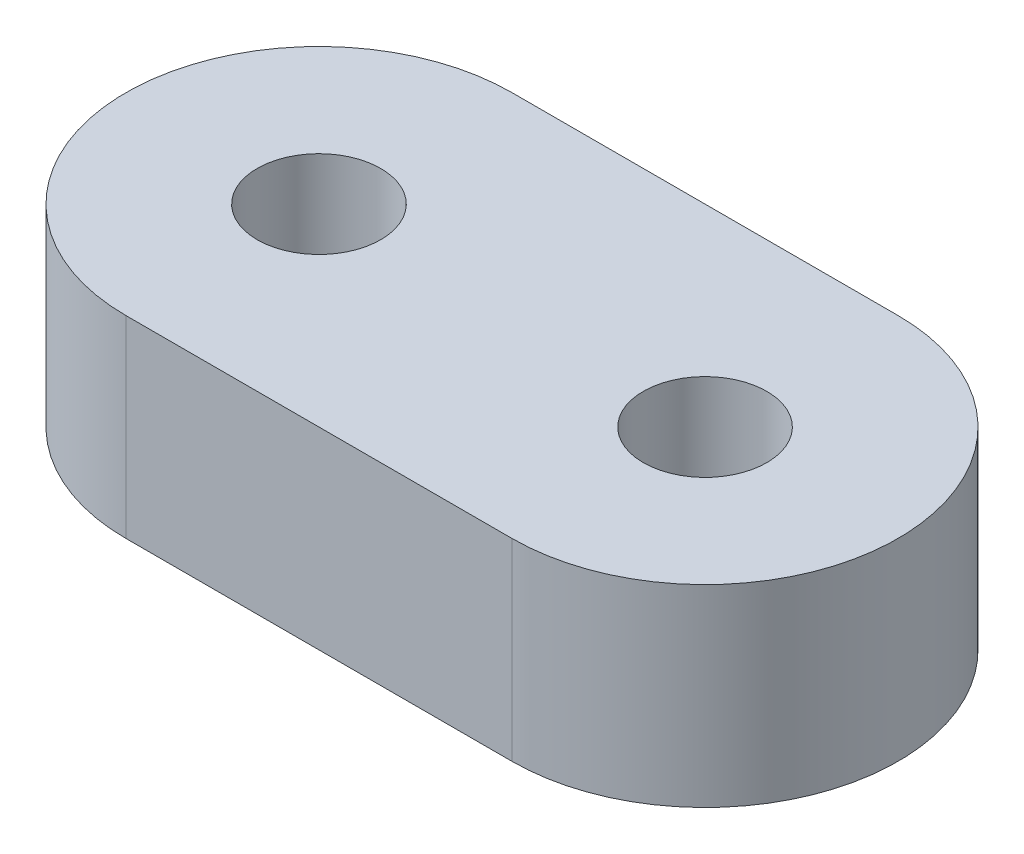
ISO-10303-21;
HEADER;
FILE_DESCRIPTION(('STEP AP214'),'2;1');
FILE_NAME('part.step','',(''),(''),'','','');
FILE_SCHEMA(('AUTOMOTIVE_DESIGN { 1 0 10303 214 1 1 1 1 }'));
ENDSEC;
DATA;
#1=APPLICATION_CONTEXT('core data for automotive mechanical design processes');
#2=APPLICATION_PROTOCOL_DEFINITION('international standard','automotive_design',2000,#1);
#3=PRODUCT_CONTEXT('',#1,'mechanical');
#4=PRODUCT('Part','Part','',(#3));
#5=PRODUCT_RELATED_PRODUCT_CATEGORY('part','',(#4));
#6=PRODUCT_DEFINITION_FORMATION('','',#4);
#7=PRODUCT_DEFINITION_CONTEXT('part definition',#1,'design');
#8=PRODUCT_DEFINITION('design','',#6,#7);
#9=PRODUCT_DEFINITION_SHAPE('','',#8);
#10=(LENGTH_UNIT() NAMED_UNIT(*) SI_UNIT(.MILLI.,.METRE.));
#11=(NAMED_UNIT(*) PLANE_ANGLE_UNIT() SI_UNIT($,.RADIAN.));
#12=(NAMED_UNIT(*) SI_UNIT($,.STERADIAN.) SOLID_ANGLE_UNIT());
#13=UNCERTAINTY_MEASURE_WITH_UNIT(LENGTH_MEASURE(1.E-05),#10,'distance_accuracy_value','');
#14=(GEOMETRIC_REPRESENTATION_CONTEXT(3) GLOBAL_UNCERTAINTY_ASSIGNED_CONTEXT((#13)) GLOBAL_UNIT_ASSIGNED_CONTEXT((#10,
#11,#12)) REPRESENTATION_CONTEXT('',''));
#15=CARTESIAN_POINT('',(0.,0.,0.));
#16=DIRECTION('',(0.,0.,1.));
#17=DIRECTION('',(1.,0.,0.));
#18=AXIS2_PLACEMENT_3D('',#15,#16,#17);
#19=CARTESIAN_POINT('',(5.,2.5,0.));
#20=DIRECTION('',(0.,1.,0.));
#21=DIRECTION('',(0.,0.,1.));
#22=AXIS2_PLACEMENT_3D('',#19,#20,#21);
#23=PLANE('',#22);
#24=CARTESIAN_POINT('',(-5.,2.5,0.));
#25=DIRECTION('',(0.,1.,0.));
#26=DIRECTION('',(0.,0.,1.));
#27=AXIS2_PLACEMENT_3D('',#24,#25,#26);
#28=CIRCLE('',#27,1.6);
#29=CARTESIAN_POINT('',(-5.,2.5,1.6));
#30=VERTEX_POINT('',#29);
#31=EDGE_CURVE('E100',#30,#30,#28,.T.);
#32=ORIENTED_EDGE('',*,*,#31,.F.);
#33=EDGE_LOOP('',(#32));
#34=FACE_BOUND('',#33,.T.);
#35=CARTESIAN_POINT('',(5.,2.5,0.));
#36=DIRECTION('',(0.,1.,0.));
#37=DIRECTION('',(0.,0.,1.));
#38=AXIS2_PLACEMENT_3D('',#35,#36,#37);
#39=CIRCLE('',#38,5.);
#40=CARTESIAN_POINT('',(5.,2.5,5.));
#41=VERTEX_POINT('',#40);
#42=CARTESIAN_POINT('',(5.,2.5,-5.));
#43=VERTEX_POINT('',#42);
#44=EDGE_CURVE('E85',#41,#43,#39,.T.);
#45=ORIENTED_EDGE('',*,*,#44,.T.);
#46=DIRECTION('',(-1.,0.,0.));
#47=VECTOR('',#46,1.);
#48=CARTESIAN_POINT('',(5.,2.5,-5.));
#49=LINE('',#48,#47);
#50=CARTESIAN_POINT('',(-5.,2.5,-5.));
#51=VERTEX_POINT('',#50);
#52=EDGE_CURVE('E80',#43,#51,#49,.T.);
#53=ORIENTED_EDGE('',*,*,#52,.T.);
#54=CARTESIAN_POINT('',(-5.,2.5,0.));
#55=DIRECTION('',(0.,1.,0.));
#56=DIRECTION('',(0.,0.,1.));
#57=AXIS2_PLACEMENT_3D('',#54,#55,#56);
#58=CIRCLE('',#57,5.);
#59=CARTESIAN_POINT('',(-5.,2.5,5.));
#60=VERTEX_POINT('',#59);
#61=EDGE_CURVE('E83',#51,#60,#58,.T.);
#62=ORIENTED_EDGE('',*,*,#61,.T.);
#63=DIRECTION('',(1.,0.,0.));
#64=VECTOR('',#63,1.);
#65=CARTESIAN_POINT('',(5.,2.5,5.));
#66=LINE('',#65,#64);
#67=EDGE_CURVE('E50',#60,#41,#66,.T.);
#68=ORIENTED_EDGE('',*,*,#67,.T.);
#69=EDGE_LOOP('',(#45,#53,#62,#68));
#70=FACE_BOUND('',#69,.T.);
#71=CARTESIAN_POINT('',(5.,2.5,0.));
#72=DIRECTION('',(0.,1.,0.));
#73=DIRECTION('',(0.,0.,1.));
#74=AXIS2_PLACEMENT_3D('',#71,#72,#73);
#75=CIRCLE('',#74,1.6);
#76=CARTESIAN_POINT('',(5.,2.5,1.6));
#77=VERTEX_POINT('',#76);
#78=EDGE_CURVE('E115',#77,#77,#75,.T.);
#79=ORIENTED_EDGE('',*,*,#78,.F.);
#80=EDGE_LOOP('',(#79));
#81=FACE_BOUND('',#80,.T.);
#82=ADVANCED_FACE('F33',(#34,#70,#81),#23,.T.);
#83=CARTESIAN_POINT('',(5.,-2.5,0.));
#84=DIRECTION('',(0.,1.,0.));
#85=DIRECTION('',(0.,0.,1.));
#86=AXIS2_PLACEMENT_3D('',#83,#84,#85);
#87=PLANE('',#86);
#88=CARTESIAN_POINT('',(5.,-2.5,0.));
#89=DIRECTION('',(0.,1.,0.));
#90=DIRECTION('',(0.,0.,1.));
#91=AXIS2_PLACEMENT_3D('',#88,#89,#90);
#92=CIRCLE('',#91,5.);
#93=CARTESIAN_POINT('',(5.,-2.5,5.));
#94=VERTEX_POINT('',#93);
#95=CARTESIAN_POINT('',(5.,-2.5,-5.));
#96=VERTEX_POINT('',#95);
#97=EDGE_CURVE('E97',#94,#96,#92,.T.);
#98=ORIENTED_EDGE('',*,*,#97,.F.);
#99=DIRECTION('',(1.,0.,0.));
#100=VECTOR('',#99,1.);
#101=CARTESIAN_POINT('',(5.,-2.5,5.));
#102=LINE('',#101,#100);
#103=CARTESIAN_POINT('',(-5.,-2.5,5.));
#104=VERTEX_POINT('',#103);
#105=EDGE_CURVE('E73',#104,#94,#102,.T.);
#106=ORIENTED_EDGE('',*,*,#105,.F.);
#107=CARTESIAN_POINT('',(-5.,-2.5,0.));
#108=DIRECTION('',(0.,1.,0.));
#109=DIRECTION('',(0.,0.,1.));
#110=AXIS2_PLACEMENT_3D('',#107,#108,#109);
#111=CIRCLE('',#110,5.);
#112=CARTESIAN_POINT('',(-5.,-2.5,-5.));
#113=VERTEX_POINT('',#112);
#114=EDGE_CURVE('E67',#113,#104,#111,.T.);
#115=ORIENTED_EDGE('',*,*,#114,.F.);
#116=DIRECTION('',(-1.,0.,0.));
#117=VECTOR('',#116,1.);
#118=CARTESIAN_POINT('',(5.,-2.5,-5.));
#119=LINE('',#118,#117);
#120=EDGE_CURVE('E89',#96,#113,#119,.T.);
#121=ORIENTED_EDGE('',*,*,#120,.F.);
#122=EDGE_LOOP('',(#98,#106,#115,#121));
#123=FACE_BOUND('',#122,.T.);
#124=CARTESIAN_POINT('',(-5.,-2.5,0.));
#125=DIRECTION('',(0.,1.,0.));
#126=DIRECTION('',(0.,0.,1.));
#127=AXIS2_PLACEMENT_3D('',#124,#125,#126);
#128=CIRCLE('',#127,1.6);
#129=CARTESIAN_POINT('',(-5.,-2.5,1.6));
#130=VERTEX_POINT('',#129);
#131=EDGE_CURVE('E112',#130,#130,#128,.T.);
#132=ORIENTED_EDGE('',*,*,#131,.T.);
#133=EDGE_LOOP('',(#132));
#134=FACE_BOUND('',#133,.T.);
#135=CARTESIAN_POINT('',(5.,-2.5,0.));
#136=DIRECTION('',(0.,1.,0.));
#137=DIRECTION('',(0.,0.,1.));
#138=AXIS2_PLACEMENT_3D('',#135,#136,#137);
#139=CIRCLE('',#138,1.6);
#140=CARTESIAN_POINT('',(5.,-2.5,1.6));
#141=VERTEX_POINT('',#140);
#142=EDGE_CURVE('E118',#141,#141,#139,.T.);
#143=ORIENTED_EDGE('',*,*,#142,.T.);
#144=EDGE_LOOP('',(#143));
#145=FACE_BOUND('',#144,.T.);
#146=ADVANCED_FACE('F108',(#123,#134,#145),#87,.F.);
#147=CARTESIAN_POINT('',(5.,2.5,0.));
#148=DIRECTION('',(0.,-1.,0.));
#149=DIRECTION('',(0.,0.,-1.));
#150=AXIS2_PLACEMENT_3D('',#147,#148,#149);
#151=CYLINDRICAL_SURFACE('',#150,5.);
#152=ORIENTED_EDGE('',*,*,#97,.T.);
#153=DIRECTION('',(0.,-1.,0.));
#154=VECTOR('',#153,1.);
#155=CARTESIAN_POINT('',(5.,2.5,-5.));
#156=LINE('',#155,#154);
#157=EDGE_CURVE('E11',#43,#96,#156,.T.);
#158=ORIENTED_EDGE('',*,*,#157,.F.);
#159=ORIENTED_EDGE('',*,*,#44,.F.);
#160=DIRECTION('',(0.,-1.,0.));
#161=VECTOR('',#160,1.);
#162=CARTESIAN_POINT('',(5.,2.5,5.));
#163=LINE('',#162,#161);
#164=EDGE_CURVE('E93',#41,#94,#163,.T.);
#165=ORIENTED_EDGE('',*,*,#164,.T.);
#166=EDGE_LOOP('',(#152,#158,#159,#165));
#167=FACE_BOUND('',#166,.T.);
#168=ADVANCED_FACE('F35',(#167),#151,.T.);
#169=CARTESIAN_POINT('',(5.,2.5,-5.));
#170=DIRECTION('',(0.,0.,1.));
#171=DIRECTION('',(1.,0.,0.));
#172=AXIS2_PLACEMENT_3D('',#169,#170,#171);
#173=PLANE('',#172);
#174=ORIENTED_EDGE('',*,*,#120,.T.);
#175=DIRECTION('',(0.,-1.,0.));
#176=VECTOR('',#175,1.);
#177=CARTESIAN_POINT('',(-5.,2.5,-5.));
#178=LINE('',#177,#176);
#179=EDGE_CURVE('E42',#51,#113,#178,.T.);
#180=ORIENTED_EDGE('',*,*,#179,.F.);
#181=ORIENTED_EDGE('',*,*,#52,.F.);
#182=ORIENTED_EDGE('',*,*,#157,.T.);
#183=EDGE_LOOP('',(#174,#180,#181,#182));
#184=FACE_BOUND('',#183,.T.);
#185=ADVANCED_FACE('F88',(#184),#173,.F.);
#186=CARTESIAN_POINT('',(-5.,2.5,0.));
#187=DIRECTION('',(0.,-1.,0.));
#188=DIRECTION('',(0.,0.,-1.));
#189=AXIS2_PLACEMENT_3D('',#186,#187,#188);
#190=CYLINDRICAL_SURFACE('',#189,5.);
#191=ORIENTED_EDGE('',*,*,#114,.T.);
#192=DIRECTION('',(0.,-1.,0.));
#193=VECTOR('',#192,1.);
#194=CARTESIAN_POINT('',(-5.,2.5,5.));
#195=LINE('',#194,#193);
#196=EDGE_CURVE('E90',#60,#104,#195,.T.);
#197=ORIENTED_EDGE('',*,*,#196,.F.);
#198=ORIENTED_EDGE('',*,*,#61,.F.);
#199=ORIENTED_EDGE('',*,*,#179,.T.);
#200=EDGE_LOOP('',(#191,#197,#198,#199));
#201=FACE_BOUND('',#200,.T.);
#202=ADVANCED_FACE('F91',(#201),#190,.T.);
#203=CARTESIAN_POINT('',(5.,2.5,5.));
#204=DIRECTION('',(0.,0.,-1.));
#205=DIRECTION('',(-1.,0.,0.));
#206=AXIS2_PLACEMENT_3D('',#203,#204,#205);
#207=PLANE('',#206);
#208=ORIENTED_EDGE('',*,*,#105,.T.);
#209=ORIENTED_EDGE('',*,*,#164,.F.);
#210=ORIENTED_EDGE('',*,*,#67,.F.);
#211=ORIENTED_EDGE('',*,*,#196,.T.);
#212=EDGE_LOOP('',(#208,#209,#210,#211));
#213=FACE_BOUND('',#212,.T.);
#214=ADVANCED_FACE('F105',(#213),#207,.F.);
#215=CARTESIAN_POINT('',(-5.,2.5,0.));
#216=DIRECTION('',(0.,-1.,0.));
#217=DIRECTION('',(0.,0.,-1.));
#218=AXIS2_PLACEMENT_3D('',#215,#216,#217);
#219=CYLINDRICAL_SURFACE('',#218,1.6);
#220=ORIENTED_EDGE('',*,*,#31,.T.);
#221=EDGE_LOOP('',(#220));
#222=FACE_BOUND('',#221,.T.);
#223=ORIENTED_EDGE('',*,*,#131,.F.);
#224=EDGE_LOOP('',(#223));
#225=FACE_BOUND('',#224,.T.);
#226=ADVANCED_FACE('F135',(#222,#225),#219,.F.);
#227=CARTESIAN_POINT('',(5.,2.5,0.));
#228=DIRECTION('',(0.,-1.,0.));
#229=DIRECTION('',(0.,0.,-1.));
#230=AXIS2_PLACEMENT_3D('',#227,#228,#229);
#231=CYLINDRICAL_SURFACE('',#230,1.6);
#232=ORIENTED_EDGE('',*,*,#78,.T.);
#233=EDGE_LOOP('',(#232));
#234=FACE_BOUND('',#233,.T.);
#235=ORIENTED_EDGE('',*,*,#142,.F.);
#236=EDGE_LOOP('',(#235));
#237=FACE_BOUND('',#236,.T.);
#238=ADVANCED_FACE('F124',(#234,#237),#231,.F.);
#239=CLOSED_SHELL('',(#82,#146,#168,#185,#202,#214,#226,#238));
#240=MANIFOLD_SOLID_BREP('B2',#239);
#241=ADVANCED_BREP_SHAPE_REPRESENTATION('',(#18,#240),#14);
#242=SHAPE_DEFINITION_REPRESENTATION(#9,#241);
ENDSEC;
END-ISO-10303-21;
